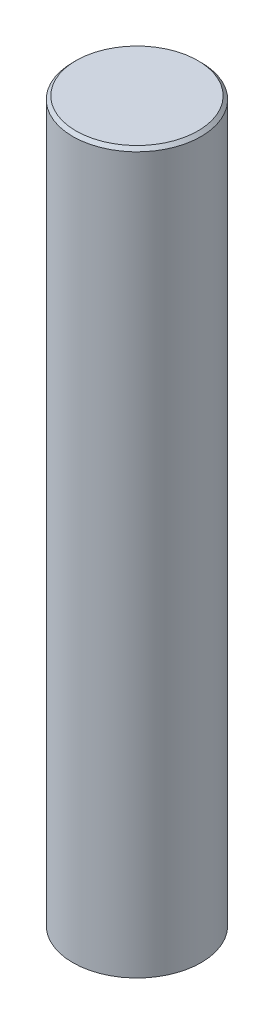
ISO-10303-21;
HEADER;
FILE_DESCRIPTION(('STEP AP214'),'2;1');
FILE_NAME('part.step','',(''),(''),'','','');
FILE_SCHEMA(('AUTOMOTIVE_DESIGN { 1 0 10303 214 1 1 1 1 }'));
ENDSEC;
DATA;
#1=APPLICATION_CONTEXT('core data for automotive mechanical design processes');
#2=APPLICATION_PROTOCOL_DEFINITION('international standard','automotive_design',2000,#1);
#3=PRODUCT_CONTEXT('',#1,'mechanical');
#4=PRODUCT('Part','Part','',(#3));
#5=PRODUCT_RELATED_PRODUCT_CATEGORY('part','',(#4));
#6=PRODUCT_DEFINITION_FORMATION('','',#4);
#7=PRODUCT_DEFINITION_CONTEXT('part definition',#1,'design');
#8=PRODUCT_DEFINITION('design','',#6,#7);
#9=PRODUCT_DEFINITION_SHAPE('','',#8);
#10=(LENGTH_UNIT() NAMED_UNIT(*) SI_UNIT(.MILLI.,.METRE.));
#11=(NAMED_UNIT(*) PLANE_ANGLE_UNIT() SI_UNIT($,.RADIAN.));
#12=(NAMED_UNIT(*) SI_UNIT($,.STERADIAN.) SOLID_ANGLE_UNIT());
#13=UNCERTAINTY_MEASURE_WITH_UNIT(LENGTH_MEASURE(1.E-05),#10,'distance_accuracy_value','');
#14=(GEOMETRIC_REPRESENTATION_CONTEXT(3) GLOBAL_UNCERTAINTY_ASSIGNED_CONTEXT((#13)) GLOBAL_UNIT_ASSIGNED_CONTEXT((#10,
#11,#12)) REPRESENTATION_CONTEXT('',''));
#15=CARTESIAN_POINT('',(0.,0.,0.));
#16=DIRECTION('',(0.,0.,1.));
#17=DIRECTION('',(1.,0.,0.));
#18=AXIS2_PLACEMENT_3D('',#15,#16,#17);
#19=CARTESIAN_POINT('',(0.,224.,0.));
#20=DIRECTION('',(0.,-1.,0.));
#21=DIRECTION('',(0.,0.,-1.));
#22=AXIS2_PLACEMENT_3D('',#19,#20,#21);
#23=CYLINDRICAL_SURFACE('',#22,20.);
#24=CARTESIAN_POINT('',(0.,223.,0.));
#25=DIRECTION('',(0.,1.,0.));
#26=DIRECTION('',(0.,0.,1.));
#27=AXIS2_PLACEMENT_3D('',#24,#25,#26);
#28=CIRCLE('',#27,20.);
#29=CARTESIAN_POINT('',(0.,223.,20.));
#30=VERTEX_POINT('',#29);
#31=EDGE_CURVE('E10',#30,#30,#28,.F.);
#32=ORIENTED_EDGE('',*,*,#31,.T.);
#33=EDGE_LOOP('',(#32));
#34=FACE_BOUND('',#33,.T.);
#35=CARTESIAN_POINT('',(0.,0.,0.));
#36=DIRECTION('',(0.,1.,0.));
#37=DIRECTION('',(0.,0.,1.));
#38=AXIS2_PLACEMENT_3D('',#35,#36,#37);
#39=CIRCLE('',#38,20.);
#40=CARTESIAN_POINT('',(0.,0.,20.));
#41=VERTEX_POINT('',#40);
#42=EDGE_CURVE('E42',#41,#41,#39,.T.);
#43=ORIENTED_EDGE('',*,*,#42,.T.);
#44=EDGE_LOOP('',(#43));
#45=FACE_BOUND('',#44,.T.);
#46=ADVANCED_FACE('F31',(#34,#45),#23,.T.);
#47=CARTESIAN_POINT('',(0.,224.,0.));
#48=DIRECTION('',(0.,1.,0.));
#49=DIRECTION('',(0.,0.,1.));
#50=AXIS2_PLACEMENT_3D('',#47,#48,#49);
#51=PLANE('',#50);
#52=CARTESIAN_POINT('',(0.,224.,0.));
#53=DIRECTION('',(0.,1.,0.));
#54=DIRECTION('',(0.,0.,1.));
#55=AXIS2_PLACEMENT_3D('',#52,#53,#54);
#56=CIRCLE('',#55,19.);
#57=CARTESIAN_POINT('',(0.,224.,19.));
#58=VERTEX_POINT('',#57);
#59=EDGE_CURVE('E38',#58,#58,#56,.T.);
#60=ORIENTED_EDGE('',*,*,#59,.T.);
#61=EDGE_LOOP('',(#60));
#62=FACE_BOUND('',#61,.T.);
#63=ADVANCED_FACE('F52',(#62),#51,.T.);
#64=CARTESIAN_POINT('',(0.,0.,0.));
#65=DIRECTION('',(0.,1.,0.));
#66=DIRECTION('',(0.,0.,1.));
#67=AXIS2_PLACEMENT_3D('',#64,#65,#66);
#68=PLANE('',#67);
#69=ORIENTED_EDGE('',*,*,#42,.F.);
#70=EDGE_LOOP('',(#69));
#71=FACE_BOUND('',#70,.T.);
#72=ADVANCED_FACE('F50',(#71),#68,.F.);
#73=CARTESIAN_POINT('',(0.,224.,0.));
#74=DIRECTION('',(0.,-1.,0.));
#75=DIRECTION('',(0.,0.,-1.));
#76=AXIS2_PLACEMENT_3D('',#73,#74,#75);
#77=CONICAL_SURFACE('',#76,19.,0.785398163397454);
#78=ORIENTED_EDGE('',*,*,#31,.F.);
#79=EDGE_LOOP('',(#78));
#80=FACE_BOUND('',#79,.T.);
#81=ORIENTED_EDGE('',*,*,#59,.F.);
#82=EDGE_LOOP('',(#81));
#83=FACE_BOUND('',#82,.T.);
#84=ADVANCED_FACE('F33',(#80,#83),#77,.T.);
#85=CLOSED_SHELL('',(#46,#63,#72,#84));
#86=MANIFOLD_SOLID_BREP('B2',#85);
#87=ADVANCED_BREP_SHAPE_REPRESENTATION('',(#18,#86),#14);
#88=SHAPE_DEFINITION_REPRESENTATION(#9,#87);
ENDSEC;
END-ISO-10303-21;
